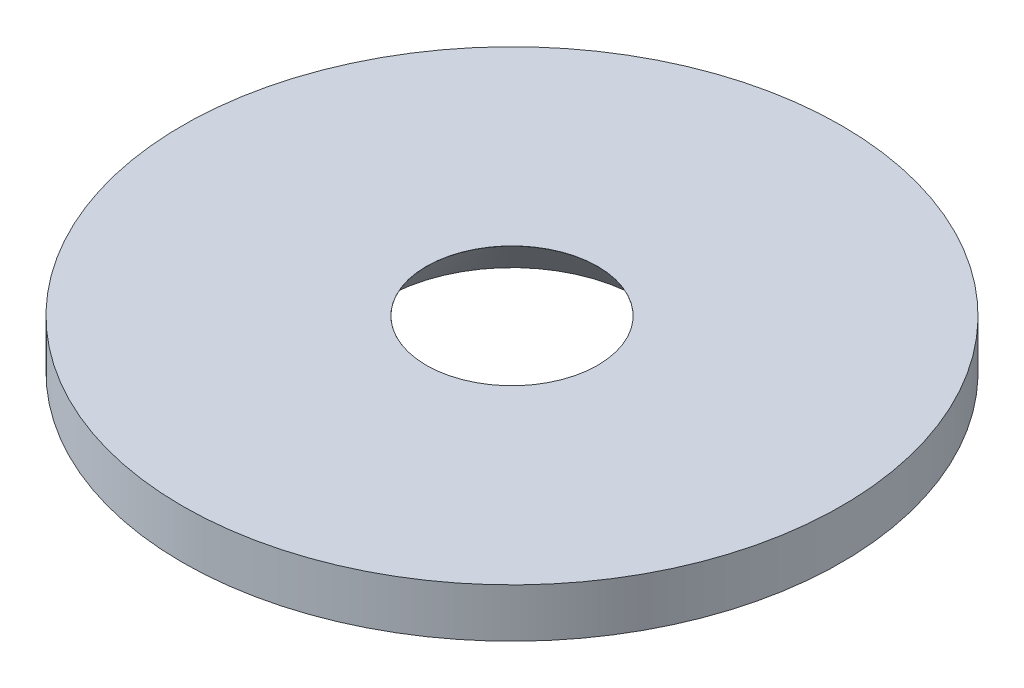
ISO-10303-21;
HEADER;
FILE_DESCRIPTION(('STEP AP214'),'2;1');
FILE_NAME('part.step','',(''),(''),'','','');
FILE_SCHEMA(('AUTOMOTIVE_DESIGN { 1 0 10303 214 1 1 1 1 }'));
ENDSEC;
DATA;
#1=APPLICATION_CONTEXT('core data for automotive mechanical design processes');
#2=APPLICATION_PROTOCOL_DEFINITION('international standard','automotive_design',2000,#1);
#3=PRODUCT_CONTEXT('',#1,'mechanical');
#4=PRODUCT('Part','Part','',(#3));
#5=PRODUCT_RELATED_PRODUCT_CATEGORY('part','',(#4));
#6=PRODUCT_DEFINITION_FORMATION('','',#4);
#7=PRODUCT_DEFINITION_CONTEXT('part definition',#1,'design');
#8=PRODUCT_DEFINITION('design','',#6,#7);
#9=PRODUCT_DEFINITION_SHAPE('','',#8);
#10=(LENGTH_UNIT() NAMED_UNIT(*) SI_UNIT(.MILLI.,.METRE.));
#11=(NAMED_UNIT(*) PLANE_ANGLE_UNIT() SI_UNIT($,.RADIAN.));
#12=(NAMED_UNIT(*) SI_UNIT($,.STERADIAN.) SOLID_ANGLE_UNIT());
#13=UNCERTAINTY_MEASURE_WITH_UNIT(LENGTH_MEASURE(1.E-05),#10,'distance_accuracy_value','');
#14=(GEOMETRIC_REPRESENTATION_CONTEXT(3) GLOBAL_UNCERTAINTY_ASSIGNED_CONTEXT((#13)) GLOBAL_UNIT_ASSIGNED_CONTEXT((#10,
#11,#12)) REPRESENTATION_CONTEXT('',''));
#15=CARTESIAN_POINT('',(0.,0.,0.));
#16=DIRECTION('',(0.,0.,1.));
#17=DIRECTION('',(1.,0.,0.));
#18=AXIS2_PLACEMENT_3D('',#15,#16,#17);
#19=CARTESIAN_POINT('',(0.,2.,0.));
#20=DIRECTION('',(0.,-1.,0.));
#21=DIRECTION('',(0.,0.,-1.));
#22=AXIS2_PLACEMENT_3D('',#19,#20,#21);
#23=CYLINDRICAL_SURFACE('',#22,3.51);
#24=CARTESIAN_POINT('',(0.,2.,0.));
#25=DIRECTION('',(0.,1.,0.));
#26=DIRECTION('',(0.,0.,1.));
#27=AXIS2_PLACEMENT_3D('',#24,#25,#26);
#28=CIRCLE('',#27,3.51);
#29=CARTESIAN_POINT('',(0.,2.,3.51));
#30=VERTEX_POINT('',#29);
#31=EDGE_CURVE('E44',#30,#30,#28,.T.);
#32=ORIENTED_EDGE('',*,*,#31,.T.);
#33=EDGE_LOOP('',(#32));
#34=FACE_BOUND('',#33,.T.);
#35=CARTESIAN_POINT('',(0.,1.99426036688515,0.));
#36=DIRECTION('',(0.,-1.,0.));
#37=DIRECTION('',(0.,0.,-1.));
#38=AXIS2_PLACEMENT_3D('',#35,#36,#37);
#39=CIRCLE('',#38,3.51);
#40=CARTESIAN_POINT('',(0.,1.99426036688515,-3.51));
#41=VERTEX_POINT('',#40);
#42=EDGE_CURVE('E35',#41,#41,#39,.T.);
#43=ORIENTED_EDGE('',*,*,#42,.T.);
#44=EDGE_LOOP('',(#43));
#45=FACE_BOUND('',#44,.T.);
#46=ADVANCED_FACE('F31',(#34,#45),#23,.F.);
#47=CARTESIAN_POINT('',(0.,2.,0.));
#48=DIRECTION('',(0.,1.,0.));
#49=DIRECTION('',(0.,0.,1.));
#50=AXIS2_PLACEMENT_3D('',#47,#48,#49);
#51=PLANE('',#50);
#52=CARTESIAN_POINT('',(0.,2.,0.));
#53=DIRECTION('',(0.,1.,0.));
#54=DIRECTION('',(0.,0.,1.));
#55=AXIS2_PLACEMENT_3D('',#52,#53,#54);
#56=CIRCLE('',#55,13.5);
#57=CARTESIAN_POINT('',(0.,2.,13.5));
#58=VERTEX_POINT('',#57);
#59=EDGE_CURVE('E10',#58,#58,#56,.T.);
#60=ORIENTED_EDGE('',*,*,#59,.T.);
#61=EDGE_LOOP('',(#60));
#62=FACE_BOUND('',#61,.T.);
#63=ORIENTED_EDGE('',*,*,#31,.F.);
#64=EDGE_LOOP('',(#63));
#65=FACE_BOUND('',#64,.T.);
#66=ADVANCED_FACE('F66',(#62,#65),#51,.T.);
#67=CARTESIAN_POINT('',(0.,0.,0.));
#68=DIRECTION('',(0.,1.,0.));
#69=DIRECTION('',(0.,0.,1.));
#70=AXIS2_PLACEMENT_3D('',#67,#68,#69);
#71=PLANE('',#70);
#72=CARTESIAN_POINT('',(0.,0.,0.));
#73=DIRECTION('',(0.,-1.,0.));
#74=DIRECTION('',(0.,0.,-1.));
#75=AXIS2_PLACEMENT_3D('',#72,#73,#74);
#76=CIRCLE('',#75,5.24727164);
#77=CARTESIAN_POINT('',(0.,0.,-5.24727164));
#78=VERTEX_POINT('',#77);
#79=EDGE_CURVE('E48',#78,#78,#76,.T.);
#80=ORIENTED_EDGE('',*,*,#79,.F.);
#81=EDGE_LOOP('',(#80));
#82=FACE_BOUND('',#81,.T.);
#83=CARTESIAN_POINT('',(0.,0.,0.));
#84=DIRECTION('',(0.,1.,0.));
#85=DIRECTION('',(0.,0.,1.));
#86=AXIS2_PLACEMENT_3D('',#83,#84,#85);
#87=CIRCLE('',#86,13.5);
#88=CARTESIAN_POINT('',(0.,0.,13.5));
#89=VERTEX_POINT('',#88);
#90=EDGE_CURVE('E39',#89,#89,#87,.T.);
#91=ORIENTED_EDGE('',*,*,#90,.F.);
#92=EDGE_LOOP('',(#91));
#93=FACE_BOUND('',#92,.T.);
#94=ADVANCED_FACE('F62',(#82,#93),#71,.F.);
#95=CARTESIAN_POINT('',(0.,2.,0.));
#96=DIRECTION('',(0.,-1.,0.));
#97=DIRECTION('',(0.,0.,-1.));
#98=AXIS2_PLACEMENT_3D('',#95,#96,#97);
#99=CYLINDRICAL_SURFACE('',#98,13.5);
#100=ORIENTED_EDGE('',*,*,#59,.F.);
#101=EDGE_LOOP('',(#100));
#102=FACE_BOUND('',#101,.T.);
#103=ORIENTED_EDGE('',*,*,#90,.T.);
#104=EDGE_LOOP('',(#103));
#105=FACE_BOUND('',#104,.T.);
#106=ADVANCED_FACE('F33',(#102,#105),#99,.T.);
#107=CARTESIAN_POINT('',(0.,2.,0.));
#108=DIRECTION('',(0.,-1.,0.));
#109=DIRECTION('',(0.,0.,-1.));
#110=AXIS2_PLACEMENT_3D('',#107,#108,#109);
#111=CONICAL_SURFACE('',#110,3.505,0.716637241892204);
#112=ORIENTED_EDGE('',*,*,#42,.F.);
#113=EDGE_LOOP('',(#112));
#114=FACE_BOUND('',#113,.T.);
#115=ORIENTED_EDGE('',*,*,#79,.T.);
#116=EDGE_LOOP('',(#115));
#117=FACE_BOUND('',#116,.T.);
#118=ADVANCED_FACE('F56',(#114,#117),#111,.F.);
#119=CLOSED_SHELL('',(#46,#66,#94,#106,#118));
#120=MANIFOLD_SOLID_BREP('B2',#119);
#121=ADVANCED_BREP_SHAPE_REPRESENTATION('',(#18,#120),#14);
#122=SHAPE_DEFINITION_REPRESENTATION(#9,#121);
ENDSEC;
END-ISO-10303-21;
